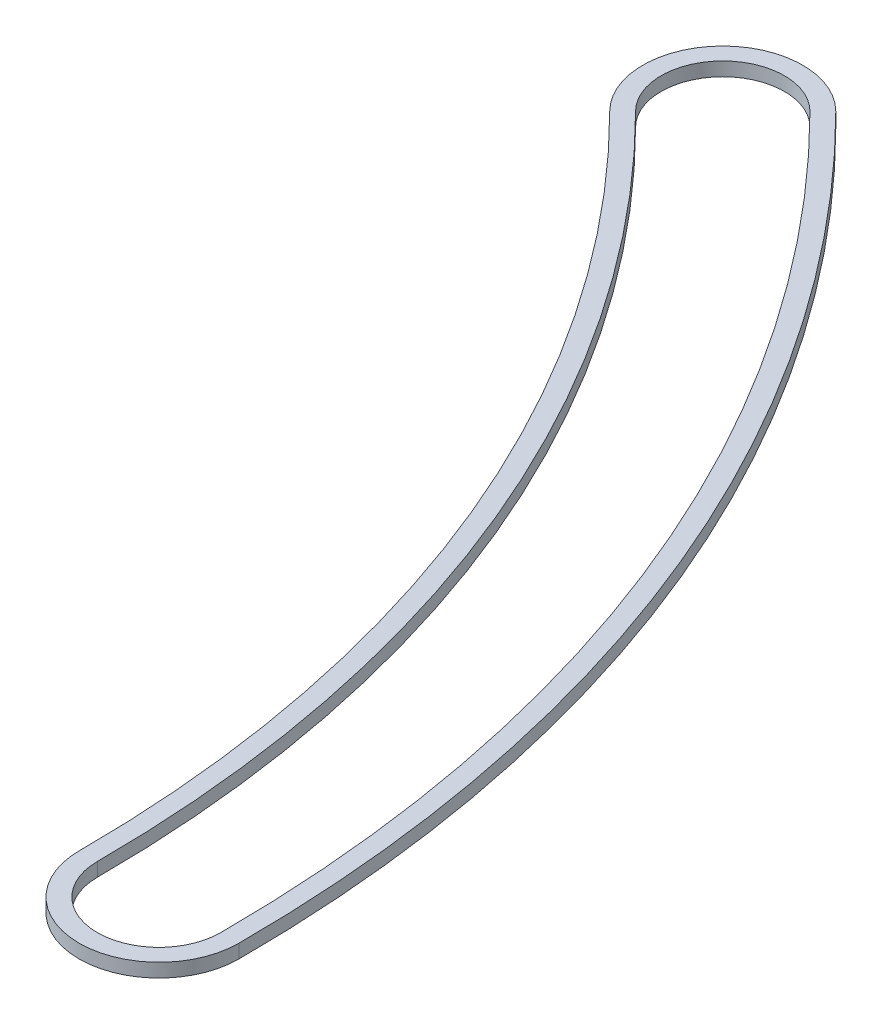
ISO-10303-21;
HEADER;
FILE_DESCRIPTION(('STEP AP214'),'2;1');
FILE_NAME('part.step','',(''),(''),'','','');
FILE_SCHEMA(('AUTOMOTIVE_DESIGN { 1 0 10303 214 1 1 1 1 }'));
ENDSEC;
DATA;
#1=APPLICATION_CONTEXT('core data for automotive mechanical design processes');
#2=APPLICATION_PROTOCOL_DEFINITION('international standard','automotive_design',2000,#1);
#3=PRODUCT_CONTEXT('',#1,'mechanical');
#4=PRODUCT('Part','Part','',(#3));
#5=PRODUCT_RELATED_PRODUCT_CATEGORY('part','',(#4));
#6=PRODUCT_DEFINITION_FORMATION('','',#4);
#7=PRODUCT_DEFINITION_CONTEXT('part definition',#1,'design');
#8=PRODUCT_DEFINITION('design','',#6,#7);
#9=PRODUCT_DEFINITION_SHAPE('','',#8);
#10=(LENGTH_UNIT() NAMED_UNIT(*) SI_UNIT(.MILLI.,.METRE.));
#11=(NAMED_UNIT(*) PLANE_ANGLE_UNIT() SI_UNIT($,.RADIAN.));
#12=(NAMED_UNIT(*) SI_UNIT($,.STERADIAN.) SOLID_ANGLE_UNIT());
#13=UNCERTAINTY_MEASURE_WITH_UNIT(LENGTH_MEASURE(1.E-05),#10,'distance_accuracy_value','');
#14=(GEOMETRIC_REPRESENTATION_CONTEXT(3) GLOBAL_UNCERTAINTY_ASSIGNED_CONTEXT((#13)) GLOBAL_UNIT_ASSIGNED_CONTEXT((#10,
#11,#12)) REPRESENTATION_CONTEXT('',''));
#15=CARTESIAN_POINT('',(0.,0.,0.));
#16=DIRECTION('',(0.,0.,1.));
#17=DIRECTION('',(1.,0.,0.));
#18=AXIS2_PLACEMENT_3D('',#15,#16,#17);
#19=CARTESIAN_POINT('',(37.846,0.762,0.));
#20=DIRECTION('',(0.,1.,0.));
#21=DIRECTION('',(0.,0.,1.));
#22=AXIS2_PLACEMENT_3D('',#19,#20,#21);
#23=PLANE('',#22);
#24=CARTESIAN_POINT('',(75.692,0.762,0.));
#25=DIRECTION('',(0.,1.,0.));
#26=DIRECTION('',(0.,0.,1.));
#27=AXIS2_PLACEMENT_3D('',#24,#25,#26);
#28=CIRCLE('',#27,4.44500000000001);
#29=CARTESIAN_POINT('',(71.247,0.762,0.));
#30=VERTEX_POINT('',#29);
#31=CARTESIAN_POINT('',(80.137,0.762,0.));
#32=VERTEX_POINT('',#31);
#33=EDGE_CURVE('E153',#30,#32,#28,.T.);
#34=ORIENTED_EDGE('',*,*,#33,.T.);
#35=CARTESIAN_POINT('',(0.,0.762,0.));
#36=DIRECTION('',(0.,1.,0.));
#37=DIRECTION('',(0.,0.,1.));
#38=AXIS2_PLACEMENT_3D('',#35,#36,#37);
#39=CIRCLE('',#38,80.137);
#40=CARTESIAN_POINT('',(56.6654161239463,0.762,-56.6654161239465));
#41=VERTEX_POINT('',#40);
#42=EDGE_CURVE('E157',#32,#41,#39,.T.);
#43=ORIENTED_EDGE('',*,*,#42,.T.);
#44=CARTESIAN_POINT('',(53.5223264815721,0.762,-53.5223264815723));
#45=DIRECTION('',(0.,1.,0.));
#46=DIRECTION('',(0.,0.,1.));
#47=AXIS2_PLACEMENT_3D('',#44,#45,#46);
#48=CIRCLE('',#47,4.44500000000001);
#49=CARTESIAN_POINT('',(50.3792368391978,0.762,-50.379236839198));
#50=VERTEX_POINT('',#49);
#51=EDGE_CURVE('E161',#41,#50,#48,.T.);
#52=ORIENTED_EDGE('',*,*,#51,.T.);
#53=CARTESIAN_POINT('',(0.,0.762,0.));
#54=DIRECTION('',(0.,-1.,0.));
#55=DIRECTION('',(0.,0.,1.));
#56=AXIS2_PLACEMENT_3D('',#53,#54,#55);
#57=CIRCLE('',#56,71.247);
#58=EDGE_CURVE('E164',#50,#30,#57,.T.);
#59=ORIENTED_EDGE('',*,*,#58,.T.);
#60=EDGE_LOOP('',(#34,#43,#52,#59));
#61=FACE_BOUND('',#60,.T.);
#62=CARTESIAN_POINT('',(0.,0.762,0.));
#63=DIRECTION('',(0.,1.,0.));
#64=DIRECTION('',(0.,0.,1.));
#65=AXIS2_PLACEMENT_3D('',#62,#63,#64);
#66=CIRCLE('',#65,79.121);
#67=CARTESIAN_POINT('',(79.121,0.762,0.));
#68=VERTEX_POINT('',#67);
#69=CARTESIAN_POINT('',(55.9469956342607,0.762,-55.9469956342609));
#70=VERTEX_POINT('',#69);
#71=EDGE_CURVE('E114',#68,#70,#66,.T.);
#72=ORIENTED_EDGE('',*,*,#71,.F.);
#73=CARTESIAN_POINT('',(75.692,0.762,0.));
#74=DIRECTION('',(0.,1.,0.));
#75=DIRECTION('',(0.,0.,1.));
#76=AXIS2_PLACEMENT_3D('',#73,#74,#75);
#77=CIRCLE('',#76,3.429);
#78=CARTESIAN_POINT('',(72.263,0.762,0.));
#79=VERTEX_POINT('',#78);
#80=EDGE_CURVE('E105',#79,#68,#77,.T.);
#81=ORIENTED_EDGE('',*,*,#80,.F.);
#82=CARTESIAN_POINT('',(0.,0.762,0.));
#83=DIRECTION('',(0.,-1.,0.));
#84=DIRECTION('',(0.,0.,1.));
#85=AXIS2_PLACEMENT_3D('',#82,#83,#84);
#86=CIRCLE('',#85,72.263);
#87=CARTESIAN_POINT('',(51.0976573288834,0.762,-51.0976573288836));
#88=VERTEX_POINT('',#87);
#89=EDGE_CURVE('E131',#88,#79,#86,.T.);
#90=ORIENTED_EDGE('',*,*,#89,.F.);
#91=CARTESIAN_POINT('',(53.5223264815721,0.762,-53.5223264815723));
#92=DIRECTION('',(0.,1.,0.));
#93=DIRECTION('',(0.,0.,1.));
#94=AXIS2_PLACEMENT_3D('',#91,#92,#93);
#95=CIRCLE('',#94,3.429);
#96=EDGE_CURVE('E127',#70,#88,#95,.T.);
#97=ORIENTED_EDGE('',*,*,#96,.F.);
#98=EDGE_LOOP('',(#72,#81,#90,#97));
#99=FACE_BOUND('',#98,.T.);
#100=ADVANCED_FACE('F39',(#61,#99),#23,.T.);
#101=CARTESIAN_POINT('',(37.846,0.,0.));
#102=DIRECTION('',(0.,1.,0.));
#103=DIRECTION('',(0.,0.,1.));
#104=AXIS2_PLACEMENT_3D('',#101,#102,#103);
#105=PLANE('',#104);
#106=CARTESIAN_POINT('',(75.692,0.,0.));
#107=DIRECTION('',(0.,1.,0.));
#108=DIRECTION('',(0.,0.,1.));
#109=AXIS2_PLACEMENT_3D('',#106,#107,#108);
#110=CIRCLE('',#109,4.44500000000001);
#111=CARTESIAN_POINT('',(71.247,0.,0.));
#112=VERTEX_POINT('',#111);
#113=CARTESIAN_POINT('',(80.137,0.,0.));
#114=VERTEX_POINT('',#113);
#115=EDGE_CURVE('E123',#112,#114,#110,.T.);
#116=ORIENTED_EDGE('',*,*,#115,.F.);
#117=CARTESIAN_POINT('',(0.,0.,0.));
#118=DIRECTION('',(0.,-1.,0.));
#119=DIRECTION('',(0.,0.,1.));
#120=AXIS2_PLACEMENT_3D('',#117,#118,#119);
#121=CIRCLE('',#120,71.247);
#122=CARTESIAN_POINT('',(50.3792368391978,0.,-50.379236839198));
#123=VERTEX_POINT('',#122);
#124=EDGE_CURVE('E158',#123,#112,#121,.T.);
#125=ORIENTED_EDGE('',*,*,#124,.F.);
#126=CARTESIAN_POINT('',(53.5223264815721,0.,-53.5223264815723));
#127=DIRECTION('',(0.,1.,0.));
#128=DIRECTION('',(0.,0.,1.));
#129=AXIS2_PLACEMENT_3D('',#126,#127,#128);
#130=CIRCLE('',#129,4.44500000000001);
#131=CARTESIAN_POINT('',(56.6654161239463,0.,-56.6654161239465));
#132=VERTEX_POINT('',#131);
#133=EDGE_CURVE('E174',#132,#123,#130,.T.);
#134=ORIENTED_EDGE('',*,*,#133,.F.);
#135=CARTESIAN_POINT('',(0.,0.,0.));
#136=DIRECTION('',(0.,1.,0.));
#137=DIRECTION('',(0.,0.,1.));
#138=AXIS2_PLACEMENT_3D('',#135,#136,#137);
#139=CIRCLE('',#138,80.137);
#140=EDGE_CURVE('E171',#114,#132,#139,.T.);
#141=ORIENTED_EDGE('',*,*,#140,.F.);
#142=EDGE_LOOP('',(#116,#125,#134,#141));
#143=FACE_BOUND('',#142,.T.);
#144=CARTESIAN_POINT('',(75.692,0.,0.));
#145=DIRECTION('',(0.,1.,0.));
#146=DIRECTION('',(0.,0.,1.));
#147=AXIS2_PLACEMENT_3D('',#144,#145,#146);
#148=CIRCLE('',#147,3.429);
#149=CARTESIAN_POINT('',(72.263,0.,0.));
#150=VERTEX_POINT('',#149);
#151=CARTESIAN_POINT('',(79.121,0.,0.));
#152=VERTEX_POINT('',#151);
#153=EDGE_CURVE('E63',#150,#152,#148,.T.);
#154=ORIENTED_EDGE('',*,*,#153,.T.);
#155=CARTESIAN_POINT('',(0.,0.,0.));
#156=DIRECTION('',(0.,1.,0.));
#157=DIRECTION('',(0.,0.,1.));
#158=AXIS2_PLACEMENT_3D('',#155,#156,#157);
#159=CIRCLE('',#158,79.121);
#160=CARTESIAN_POINT('',(55.9469956342607,0.,-55.9469956342609));
#161=VERTEX_POINT('',#160);
#162=EDGE_CURVE('E121',#152,#161,#159,.T.);
#163=ORIENTED_EDGE('',*,*,#162,.T.);
#164=CARTESIAN_POINT('',(53.5223264815721,0.,-53.5223264815723));
#165=DIRECTION('',(0.,1.,0.));
#166=DIRECTION('',(0.,0.,1.));
#167=AXIS2_PLACEMENT_3D('',#164,#165,#166);
#168=CIRCLE('',#167,3.429);
#169=CARTESIAN_POINT('',(51.0976573288834,0.,-51.0976573288836));
#170=VERTEX_POINT('',#169);
#171=EDGE_CURVE('E140',#161,#170,#168,.T.);
#172=ORIENTED_EDGE('',*,*,#171,.T.);
#173=CARTESIAN_POINT('',(0.,0.,0.));
#174=DIRECTION('',(0.,-1.,0.));
#175=DIRECTION('',(0.,0.,1.));
#176=AXIS2_PLACEMENT_3D('',#173,#174,#175);
#177=CIRCLE('',#176,72.263);
#178=EDGE_CURVE('E115',#170,#150,#177,.T.);
#179=ORIENTED_EDGE('',*,*,#178,.T.);
#180=EDGE_LOOP('',(#154,#163,#172,#179));
#181=FACE_BOUND('',#180,.T.);
#182=ADVANCED_FACE('F197',(#143,#181),#105,.F.);
#183=CARTESIAN_POINT('',(75.692,0.762,0.));
#184=DIRECTION('',(0.,-1.,0.));
#185=DIRECTION('',(0.,0.,-1.));
#186=AXIS2_PLACEMENT_3D('',#183,#184,#185);
#187=CYLINDRICAL_SURFACE('',#186,4.44500000000001);
#188=ORIENTED_EDGE('',*,*,#115,.T.);
#189=DIRECTION('',(0.,-1.,0.));
#190=VECTOR('',#189,1.);
#191=CARTESIAN_POINT('',(80.137,0.762,0.));
#192=LINE('',#191,#190);
#193=EDGE_CURVE('E11',#32,#114,#192,.T.);
#194=ORIENTED_EDGE('',*,*,#193,.F.);
#195=ORIENTED_EDGE('',*,*,#33,.F.);
#196=DIRECTION('',(0.,-1.,0.));
#197=VECTOR('',#196,1.);
#198=CARTESIAN_POINT('',(71.247,0.762,0.));
#199=LINE('',#198,#197);
#200=EDGE_CURVE('E167',#30,#112,#199,.T.);
#201=ORIENTED_EDGE('',*,*,#200,.T.);
#202=EDGE_LOOP('',(#188,#194,#195,#201));
#203=FACE_BOUND('',#202,.T.);
#204=ADVANCED_FACE('F41',(#203),#187,.T.);
#205=CARTESIAN_POINT('',(0.,0.762,0.));
#206=DIRECTION('',(0.,-1.,0.));
#207=DIRECTION('',(0.,0.,-1.));
#208=AXIS2_PLACEMENT_3D('',#205,#206,#207);
#209=CYLINDRICAL_SURFACE('',#208,80.137);
#210=ORIENTED_EDGE('',*,*,#140,.T.);
#211=DIRECTION('',(0.,-1.,0.));
#212=VECTOR('',#211,1.);
#213=CARTESIAN_POINT('',(56.6654161239463,0.762,-56.6654161239465));
#214=LINE('',#213,#212);
#215=EDGE_CURVE('E48',#41,#132,#214,.T.);
#216=ORIENTED_EDGE('',*,*,#215,.F.);
#217=ORIENTED_EDGE('',*,*,#42,.F.);
#218=ORIENTED_EDGE('',*,*,#193,.T.);
#219=EDGE_LOOP('',(#210,#216,#217,#218));
#220=FACE_BOUND('',#219,.T.);
#221=ADVANCED_FACE('F207',(#220),#209,.T.);
#222=CARTESIAN_POINT('',(53.5223264815721,0.762,-53.5223264815723));
#223=DIRECTION('',(0.,-1.,0.));
#224=DIRECTION('',(0.,0.,-1.));
#225=AXIS2_PLACEMENT_3D('',#222,#223,#224);
#226=CYLINDRICAL_SURFACE('',#225,4.44500000000001);
#227=ORIENTED_EDGE('',*,*,#133,.T.);
#228=DIRECTION('',(0.,-1.,0.));
#229=VECTOR('',#228,1.);
#230=CARTESIAN_POINT('',(50.3792368391978,0.762,-50.379236839198));
#231=LINE('',#230,#229);
#232=EDGE_CURVE('E182',#50,#123,#231,.T.);
#233=ORIENTED_EDGE('',*,*,#232,.F.);
#234=ORIENTED_EDGE('',*,*,#51,.F.);
#235=ORIENTED_EDGE('',*,*,#215,.T.);
#236=EDGE_LOOP('',(#227,#233,#234,#235));
#237=FACE_BOUND('',#236,.T.);
#238=ADVANCED_FACE('F191',(#237),#226,.T.);
#239=CARTESIAN_POINT('',(0.,0.762,0.));
#240=DIRECTION('',(0.,-1.,0.));
#241=DIRECTION('',(0.,0.,-1.));
#242=AXIS2_PLACEMENT_3D('',#239,#240,#241);
#243=CYLINDRICAL_SURFACE('',#242,71.247);
#244=ORIENTED_EDGE('',*,*,#124,.T.);
#245=ORIENTED_EDGE('',*,*,#200,.F.);
#246=ORIENTED_EDGE('',*,*,#58,.F.);
#247=ORIENTED_EDGE('',*,*,#232,.T.);
#248=EDGE_LOOP('',(#244,#245,#246,#247));
#249=FACE_BOUND('',#248,.T.);
#250=ADVANCED_FACE('F201',(#249),#243,.F.);
#251=CARTESIAN_POINT('',(75.692,0.762,0.));
#252=DIRECTION('',(0.,-1.,0.));
#253=DIRECTION('',(0.,0.,-1.));
#254=AXIS2_PLACEMENT_3D('',#251,#252,#253);
#255=CYLINDRICAL_SURFACE('',#254,3.429);
#256=ORIENTED_EDGE('',*,*,#153,.F.);
#257=DIRECTION('',(0.,-1.,0.));
#258=VECTOR('',#257,1.);
#259=CARTESIAN_POINT('',(72.263,0.762,0.));
#260=LINE('',#259,#258);
#261=EDGE_CURVE('E109',#79,#150,#260,.T.);
#262=ORIENTED_EDGE('',*,*,#261,.F.);
#263=ORIENTED_EDGE('',*,*,#80,.T.);
#264=DIRECTION('',(0.,-1.,0.));
#265=VECTOR('',#264,1.);
#266=CARTESIAN_POINT('',(79.121,0.762,0.));
#267=LINE('',#266,#265);
#268=EDGE_CURVE('E108',#68,#152,#267,.T.);
#269=ORIENTED_EDGE('',*,*,#268,.T.);
#270=EDGE_LOOP('',(#256,#262,#263,#269));
#271=FACE_BOUND('',#270,.T.);
#272=ADVANCED_FACE('F107',(#271),#255,.F.);
#273=CARTESIAN_POINT('',(0.,0.762,0.));
#274=DIRECTION('',(0.,-1.,0.));
#275=DIRECTION('',(0.,0.,-1.));
#276=AXIS2_PLACEMENT_3D('',#273,#274,#275);
#277=CYLINDRICAL_SURFACE('',#276,79.121);
#278=ORIENTED_EDGE('',*,*,#162,.F.);
#279=ORIENTED_EDGE('',*,*,#268,.F.);
#280=ORIENTED_EDGE('',*,*,#71,.T.);
#281=DIRECTION('',(0.,-1.,0.));
#282=VECTOR('',#281,1.);
#283=CARTESIAN_POINT('',(55.9469956342607,0.762,-55.9469956342609));
#284=LINE('',#283,#282);
#285=EDGE_CURVE('E124',#70,#161,#284,.T.);
#286=ORIENTED_EDGE('',*,*,#285,.T.);
#287=EDGE_LOOP('',(#278,#279,#280,#286));
#288=FACE_BOUND('',#287,.T.);
#289=ADVANCED_FACE('F118',(#288),#277,.F.);
#290=CARTESIAN_POINT('',(53.5223264815721,0.762,-53.5223264815723));
#291=DIRECTION('',(0.,-1.,0.));
#292=DIRECTION('',(0.,0.,-1.));
#293=AXIS2_PLACEMENT_3D('',#290,#291,#292);
#294=CYLINDRICAL_SURFACE('',#293,3.429);
#295=ORIENTED_EDGE('',*,*,#171,.F.);
#296=ORIENTED_EDGE('',*,*,#285,.F.);
#297=ORIENTED_EDGE('',*,*,#96,.T.);
#298=DIRECTION('',(0.,-1.,0.));
#299=VECTOR('',#298,1.);
#300=CARTESIAN_POINT('',(51.0976573288834,0.762,-51.0976573288836));
#301=LINE('',#300,#299);
#302=EDGE_CURVE('E55',#88,#170,#301,.T.);
#303=ORIENTED_EDGE('',*,*,#302,.T.);
#304=EDGE_LOOP('',(#295,#296,#297,#303));
#305=FACE_BOUND('',#304,.T.);
#306=ADVANCED_FACE('F230',(#305),#294,.F.);
#307=CARTESIAN_POINT('',(0.,0.762,0.));
#308=DIRECTION('',(0.,-1.,0.));
#309=DIRECTION('',(0.,0.,-1.));
#310=AXIS2_PLACEMENT_3D('',#307,#308,#309);
#311=CYLINDRICAL_SURFACE('',#310,72.263);
#312=ORIENTED_EDGE('',*,*,#178,.F.);
#313=ORIENTED_EDGE('',*,*,#302,.F.);
#314=ORIENTED_EDGE('',*,*,#89,.T.);
#315=ORIENTED_EDGE('',*,*,#261,.T.);
#316=EDGE_LOOP('',(#312,#313,#314,#315));
#317=FACE_BOUND('',#316,.T.);
#318=ADVANCED_FACE('F234',(#317),#311,.T.);
#319=CLOSED_SHELL('',(#100,#182,#204,#221,#238,#250,#272,#289,#306,#318));
#320=MANIFOLD_SOLID_BREP('B2',#319);
#321=ADVANCED_BREP_SHAPE_REPRESENTATION('',(#18,#320),#14);
#322=SHAPE_DEFINITION_REPRESENTATION(#9,#321);
ENDSEC;
END-ISO-10303-21;
